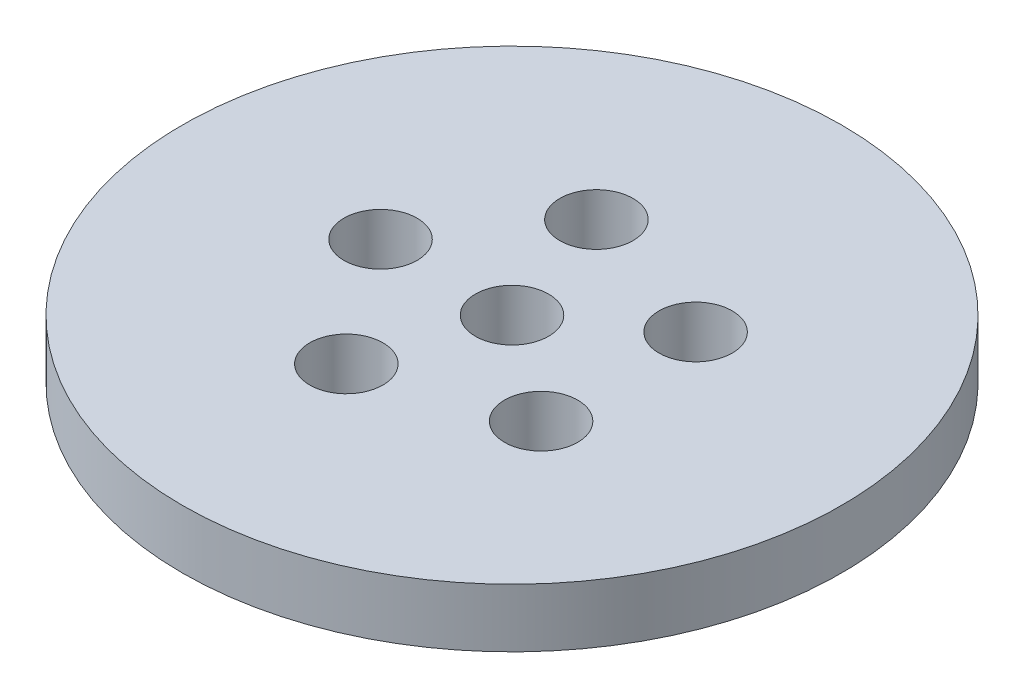
ISO-10303-21;
HEADER;
FILE_DESCRIPTION(('STEP AP214'),'2;1');
FILE_NAME('part.step','',(''),(''),'','','');
FILE_SCHEMA(('AUTOMOTIVE_DESIGN { 1 0 10303 214 1 1 1 1 }'));
ENDSEC;
DATA;
#1=APPLICATION_CONTEXT('core data for automotive mechanical design processes');
#2=APPLICATION_PROTOCOL_DEFINITION('international standard','automotive_design',2000,#1);
#3=PRODUCT_CONTEXT('',#1,'mechanical');
#4=PRODUCT('Part','Part','',(#3));
#5=PRODUCT_RELATED_PRODUCT_CATEGORY('part','',(#4));
#6=PRODUCT_DEFINITION_FORMATION('','',#4);
#7=PRODUCT_DEFINITION_CONTEXT('part definition',#1,'design');
#8=PRODUCT_DEFINITION('design','',#6,#7);
#9=PRODUCT_DEFINITION_SHAPE('','',#8);
#10=(LENGTH_UNIT() NAMED_UNIT(*) SI_UNIT(.MILLI.,.METRE.));
#11=(NAMED_UNIT(*) PLANE_ANGLE_UNIT() SI_UNIT($,.RADIAN.));
#12=(NAMED_UNIT(*) SI_UNIT($,.STERADIAN.) SOLID_ANGLE_UNIT());
#13=UNCERTAINTY_MEASURE_WITH_UNIT(LENGTH_MEASURE(1.E-05),#10,'distance_accuracy_value','');
#14=(GEOMETRIC_REPRESENTATION_CONTEXT(3) GLOBAL_UNCERTAINTY_ASSIGNED_CONTEXT((#13)) GLOBAL_UNIT_ASSIGNED_CONTEXT((#10,
#11,#12)) REPRESENTATION_CONTEXT('',''));
#15=CARTESIAN_POINT('',(0.,0.,0.));
#16=DIRECTION('',(0.,0.,1.));
#17=DIRECTION('',(1.,0.,0.));
#18=AXIS2_PLACEMENT_3D('',#15,#16,#17);
#19=CARTESIAN_POINT('',(0.,16.,0.));
#20=DIRECTION('',(0.,-1.,0.));
#21=DIRECTION('',(0.,0.,-1.));
#22=AXIS2_PLACEMENT_3D('',#19,#20,#21);
#23=CYLINDRICAL_SURFACE('',#22,90.);
#24=CARTESIAN_POINT('',(0.,16.,0.));
#25=DIRECTION('',(0.,1.,0.));
#26=DIRECTION('',(0.,0.,1.));
#27=AXIS2_PLACEMENT_3D('',#24,#25,#26);
#28=CIRCLE('',#27,90.);
#29=CARTESIAN_POINT('',(0.,16.,90.));
#30=VERTEX_POINT('',#29);
#31=EDGE_CURVE('E10',#30,#30,#28,.T.);
#32=ORIENTED_EDGE('',*,*,#31,.F.);
#33=EDGE_LOOP('',(#32));
#34=FACE_BOUND('',#33,.T.);
#35=CARTESIAN_POINT('',(0.,0.,0.));
#36=DIRECTION('',(0.,1.,0.));
#37=DIRECTION('',(0.,0.,1.));
#38=AXIS2_PLACEMENT_3D('',#35,#36,#37);
#39=CIRCLE('',#38,90.);
#40=CARTESIAN_POINT('',(0.,0.,90.));
#41=VERTEX_POINT('',#40);
#42=EDGE_CURVE('E37',#41,#41,#39,.T.);
#43=ORIENTED_EDGE('',*,*,#42,.T.);
#44=EDGE_LOOP('',(#43));
#45=FACE_BOUND('',#44,.T.);
#46=ADVANCED_FACE('F40',(#34,#45),#23,.T.);
#47=CARTESIAN_POINT('',(0.,16.,0.));
#48=DIRECTION('',(0.,1.,0.));
#49=DIRECTION('',(0.,0.,1.));
#50=AXIS2_PLACEMENT_3D('',#47,#48,#49);
#51=PLANE('',#50);
#52=CARTESIAN_POINT('',(-11.094567777278,16.,-34.1455686002023));
#53=DIRECTION('',(0.,1.,0.));
#54=DIRECTION('',(-0.95105651629515,0.,0.309016994374958));
#55=AXIS2_PLACEMENT_3D('',#52,#53,#54);
#56=CIRCLE('',#55,10.);
#57=CARTESIAN_POINT('',(-11.094567777278,16.,-24.1455686002023));
#58=VERTEX_POINT('',#57);
#59=EDGE_CURVE('E70',#58,#58,#56,.T.);
#60=ORIENTED_EDGE('',*,*,#59,.F.);
#61=EDGE_LOOP('',(#60));
#62=FACE_BOUND('',#61,.T.);
#63=CARTESIAN_POINT('',(29.0459555314021,16.,-21.1031219601165));
#64=DIRECTION('',(0.,1.,0.));
#65=DIRECTION('',(-0.58778525229248,0.,-0.809016994374942));
#66=AXIS2_PLACEMENT_3D('',#63,#64,#65);
#67=CIRCLE('',#66,10.);
#68=CARTESIAN_POINT('',(29.0459555314021,16.,-11.1031219601165));
#69=VERTEX_POINT('',#68);
#70=EDGE_CURVE('E71',#69,#69,#67,.T.);
#71=ORIENTED_EDGE('',*,*,#70,.F.);
#72=EDGE_LOOP('',(#71));
#73=FACE_BOUND('',#72,.T.);
#74=CARTESIAN_POINT('',(29.0459555314024,16.,21.1031219601161));
#75=DIRECTION('',(0.,1.,0.));
#76=DIRECTION('',(0.587785252292469,0.,-0.809016994374951));
#77=AXIS2_PLACEMENT_3D('',#74,#75,#76);
#78=CIRCLE('',#77,10.);
#79=CARTESIAN_POINT('',(29.0459555314024,16.,31.1031219601161));
#80=VERTEX_POINT('',#79);
#81=EDGE_CURVE('E78',#80,#80,#78,.T.);
#82=ORIENTED_EDGE('',*,*,#81,.F.);
#83=EDGE_LOOP('',(#82));
#84=FACE_BOUND('',#83,.T.);
#85=CARTESIAN_POINT('',(-11.0945677772775,16.,34.1455686002025));
#86=DIRECTION('',(0.,1.,0.));
#87=DIRECTION('',(0.951056516295155,0.,0.309016994374945));
#88=AXIS2_PLACEMENT_3D('',#85,#86,#87);
#89=CIRCLE('',#88,10.);
#90=CARTESIAN_POINT('',(-11.0945677772775,16.,44.1455686002025));
#91=VERTEX_POINT('',#90);
#92=EDGE_CURVE('E61',#91,#91,#89,.T.);
#93=ORIENTED_EDGE('',*,*,#92,.F.);
#94=EDGE_LOOP('',(#93));
#95=FACE_BOUND('',#94,.T.);
#96=CARTESIAN_POINT('',(-35.9027755082492,16.,0.));
#97=DIRECTION('',(0.,1.,0.));
#98=DIRECTION('',(0.,0.,1.));
#99=AXIS2_PLACEMENT_3D('',#96,#97,#98);
#100=CIRCLE('',#99,10.);
#101=CARTESIAN_POINT('',(-35.9027755082492,16.,10.));
#102=VERTEX_POINT('',#101);
#103=EDGE_CURVE('E54',#102,#102,#100,.T.);
#104=ORIENTED_EDGE('',*,*,#103,.F.);
#105=EDGE_LOOP('',(#104));
#106=FACE_BOUND('',#105,.T.);
#107=CARTESIAN_POINT('',(0.,16.,0.));
#108=DIRECTION('',(0.,1.,0.));
#109=DIRECTION('',(0.,0.,1.));
#110=AXIS2_PLACEMENT_3D('',#107,#108,#109);
#111=CIRCLE('',#110,10.);
#112=CARTESIAN_POINT('',(0.,16.,10.));
#113=VERTEX_POINT('',#112);
#114=EDGE_CURVE('E50',#113,#113,#111,.T.);
#115=ORIENTED_EDGE('',*,*,#114,.F.);
#116=EDGE_LOOP('',(#115));
#117=FACE_BOUND('',#116,.T.);
#118=ORIENTED_EDGE('',*,*,#31,.T.);
#119=EDGE_LOOP('',(#118));
#120=FACE_BOUND('',#119,.T.);
#121=ADVANCED_FACE('F94',(#62,#73,#84,#95,#106,#117,#120),#51,.T.);
#122=CARTESIAN_POINT('',(0.,0.,0.));
#123=DIRECTION('',(0.,1.,0.));
#124=DIRECTION('',(0.,0.,1.));
#125=AXIS2_PLACEMENT_3D('',#122,#123,#124);
#126=PLANE('',#125);
#127=CARTESIAN_POINT('',(0.,0.,0.));
#128=DIRECTION('',(0.,1.,0.));
#129=DIRECTION('',(0.,0.,1.));
#130=AXIS2_PLACEMENT_3D('',#127,#128,#129);
#131=CIRCLE('',#130,10.);
#132=CARTESIAN_POINT('',(0.,0.,10.));
#133=VERTEX_POINT('',#132);
#134=EDGE_CURVE('E47',#133,#133,#131,.T.);
#135=ORIENTED_EDGE('',*,*,#134,.T.);
#136=EDGE_LOOP('',(#135));
#137=FACE_BOUND('',#136,.T.);
#138=ORIENTED_EDGE('',*,*,#42,.F.);
#139=EDGE_LOOP('',(#138));
#140=FACE_BOUND('',#139,.T.);
#141=ADVANCED_FACE('F100',(#137,#140),#126,.F.);
#142=CARTESIAN_POINT('',(0.,16.,0.));
#143=DIRECTION('',(0.,-1.,0.));
#144=DIRECTION('',(0.,0.,-1.));
#145=AXIS2_PLACEMENT_3D('',#142,#143,#144);
#146=CYLINDRICAL_SURFACE('',#145,10.);
#147=ORIENTED_EDGE('',*,*,#114,.T.);
#148=EDGE_LOOP('',(#147));
#149=FACE_BOUND('',#148,.T.);
#150=ORIENTED_EDGE('',*,*,#134,.F.);
#151=EDGE_LOOP('',(#150));
#152=FACE_BOUND('',#151,.T.);
#153=ADVANCED_FACE('F106',(#149,#152),#146,.F.);
#154=CARTESIAN_POINT('',(-35.9027755082492,1.14669614993284,0.));
#155=DIRECTION('',(0.,1.,0.));
#156=DIRECTION('',(0.,0.,1.));
#157=AXIS2_PLACEMENT_3D('',#154,#155,#156);
#158=CYLINDRICAL_SURFACE('',#157,10.);
#159=CARTESIAN_POINT('',(-35.9027755082492,1.14669614993284,0.));
#160=DIRECTION('',(0.,1.,0.));
#161=DIRECTION('',(0.,0.,1.));
#162=AXIS2_PLACEMENT_3D('',#159,#160,#161);
#163=CIRCLE('',#162,10.);
#164=CARTESIAN_POINT('',(-35.9027755082492,1.14669614993284,10.));
#165=VERTEX_POINT('',#164);
#166=EDGE_CURVE('E55',#165,#165,#163,.T.);
#167=CARTESIAN_POINT('',(-35.9027755082492,1.14669614993284,10.));
#168=CARTESIAN_POINT('',(-35.9027755082492,1.30141806503771,10.));
#169=CARTESIAN_POINT('',(-35.9027755082492,1.45613998014257,10.));
#170=CARTESIAN_POINT('',(-35.9027755082492,1.7655838103523,10.));
#171=CARTESIAN_POINT('',(-35.9027755082492,1.92030572545717,10.));
#172=CARTESIAN_POINT('',(-35.9027755082492,2.2297495556669,10.));
#173=CARTESIAN_POINT('',(-35.9027755082492,2.38447147077177,10.));
#174=CARTESIAN_POINT('',(-35.9027755082492,2.6939153009815,10.));
#175=CARTESIAN_POINT('',(-35.9027755082492,2.84863721608637,10.));
#176=CARTESIAN_POINT('',(-35.9027755082492,3.1580810462961,10.));
#177=CARTESIAN_POINT('',(-35.9027755082492,3.31280296140097,10.));
#178=CARTESIAN_POINT('',(-35.9027755082492,3.6222467916107,10.));
#179=CARTESIAN_POINT('',(-35.9027755082492,3.77696870671557,10.));
#180=CARTESIAN_POINT('',(-35.9027755082492,4.0864125369253,10.));
#181=CARTESIAN_POINT('',(-35.9027755082492,4.24113445203017,10.));
#182=CARTESIAN_POINT('',(-35.9027755082492,4.5505782822399,10.));
#183=CARTESIAN_POINT('',(-35.9027755082492,4.70530019734476,10.));
#184=CARTESIAN_POINT('',(-35.9027755082492,5.0147440275545,10.));
#185=CARTESIAN_POINT('',(-35.9027755082492,5.16946594265936,10.));
#186=CARTESIAN_POINT('',(-35.9027755082492,5.47890977286909,10.));
#187=CARTESIAN_POINT('',(-35.9027755082492,5.63363168797396,10.));
#188=CARTESIAN_POINT('',(-35.9027755082492,5.94307551818369,10.));
#189=CARTESIAN_POINT('',(-35.9027755082492,6.09779743328856,10.));
#190=CARTESIAN_POINT('',(-35.9027755082492,6.40724126349829,10.));
#191=CARTESIAN_POINT('',(-35.9027755082492,6.56196317860316,10.));
#192=CARTESIAN_POINT('',(-35.9027755082492,6.87140700881289,10.));
#193=CARTESIAN_POINT('',(-35.9027755082492,7.02612892391776,10.));
#194=CARTESIAN_POINT('',(-35.9027755082492,7.33557275412749,10.));
#195=CARTESIAN_POINT('',(-35.9027755082492,7.49029466923236,10.));
#196=CARTESIAN_POINT('',(-35.9027755082492,7.79973849944209,10.));
#197=CARTESIAN_POINT('',(-35.9027755082492,7.95446041454695,10.));
#198=CARTESIAN_POINT('',(-35.9027755082492,8.26390424475669,10.));
#199=CARTESIAN_POINT('',(-35.9027755082492,8.41862615986155,10.));
#200=CARTESIAN_POINT('',(-35.9027755082492,8.72806999007129,10.));
#201=CARTESIAN_POINT('',(-35.9027755082492,8.88279190517615,10.));
#202=CARTESIAN_POINT('',(-35.9027755082492,9.19223573538588,10.));
#203=CARTESIAN_POINT('',(-35.9027755082492,9.34695765049075,10.));
#204=CARTESIAN_POINT('',(-35.9027755082492,9.65640148070048,10.));
#205=CARTESIAN_POINT('',(-35.9027755082492,9.81112339580535,10.));
#206=CARTESIAN_POINT('',(-35.9027755082492,10.1205672260151,10.));
#207=CARTESIAN_POINT('',(-35.9027755082492,10.2752891411199,10.));
#208=CARTESIAN_POINT('',(-35.9027755082492,10.5847329713297,10.));
#209=CARTESIAN_POINT('',(-35.9027755082492,10.7394548864345,10.));
#210=CARTESIAN_POINT('',(-35.9027755082492,11.0488987166443,10.));
#211=CARTESIAN_POINT('',(-35.9027755082492,11.2036206317491,10.));
#212=CARTESIAN_POINT('',(-35.9027755082492,11.5130644619589,10.));
#213=CARTESIAN_POINT('',(-35.9027755082492,11.6677863770637,10.));
#214=CARTESIAN_POINT('',(-35.9027755082492,11.9772302072735,10.));
#215=CARTESIAN_POINT('',(-35.9027755082492,12.1319521223783,10.));
#216=CARTESIAN_POINT('',(-35.9027755082492,12.4413959525881,10.));
#217=CARTESIAN_POINT('',(-35.9027755082492,12.5961178676929,10.));
#218=CARTESIAN_POINT('',(-35.9027755082492,12.9055616979027,10.));
#219=CARTESIAN_POINT('',(-35.9027755082492,13.0602836130075,10.));
#220=CARTESIAN_POINT('',(-35.9027755082492,13.3697274432173,10.));
#221=CARTESIAN_POINT('',(-35.9027755082492,13.5244493583221,10.));
#222=CARTESIAN_POINT('',(-35.9027755082492,13.8338931885319,10.));
#223=CARTESIAN_POINT('',(-35.9027755082492,13.9886151036367,10.));
#224=CARTESIAN_POINT('',(-35.9027755082492,14.2980589338465,10.));
#225=CARTESIAN_POINT('',(-35.9027755082492,14.4527808489513,10.));
#226=CARTESIAN_POINT('',(-35.9027755082492,14.7622246791611,10.));
#227=CARTESIAN_POINT('',(-35.9027755082492,14.9169465942659,10.));
#228=CARTESIAN_POINT('',(-35.9027755082492,15.2263904244757,10.));
#229=CARTESIAN_POINT('',(-35.9027755082492,15.3811123395805,10.));
#230=CARTESIAN_POINT('',(-35.9027755082492,15.6905561697903,10.));
#231=CARTESIAN_POINT('',(-35.9027755082492,15.8452780848951,10.));
#232=CARTESIAN_POINT('',(-35.9027755082492,16.,10.));
#233=B_SPLINE_CURVE_WITH_KNOTS('',3,(#167,#168,#169,#170,#171,#172,#173,#174,#175,#176,#177,
#178,#179,#180,#181,#182,#183,#184,#185,#186,#187,#188,#189,#190,#191,#192,#193,#194,#195,#196,
#197,#198,#199,#200,#201,#202,#203,#204,#205,#206,#207,#208,#209,#210,#211,#212,#213,#214,#215,
#216,#217,#218,#219,#220,#221,#222,#223,#224,#225,#226,#227,#228,#229,#230,#231,#232),
.UNSPECIFIED.,.F.,.F.,(4,2,2,2,2,2,2,2,2,2,2,2,2,2,2,2,2,2,2,2,2,2,2,2,2,2,2,2,2,2,2,2,4),(0.,
0.464165745314599,0.928331490629197,1.3924972359438,1.85666298125839,2.32082872657299,
2.78499447188759,3.24916021720219,3.71332596251679,4.17749170783139,4.64165745314599,
5.10582319846059,5.56998894377519,6.03415468908978,6.49832043440438,6.96248617971898,
7.42665192503358,7.89081767034818,8.35498341566278,8.81914916097737,9.28331490629197,
9.74748065160657,10.2116463969212,10.6758121422358,11.1399778875504,11.604143632865,
12.0683093781796,12.5324751234942,12.9966408688088,13.4608066141234,13.924972359438,
14.3891381047526,14.8533038500672),.UNSPECIFIED.);
#234=EDGE_CURVE('BSEAM108',#165,#102,#233,.T.);
#235=ORIENTED_EDGE('',*,*,#166,.F.);
#236=ORIENTED_EDGE('',*,*,#103,.T.);
#237=ORIENTED_EDGE('',*,*,#234,.T.);
#238=ORIENTED_EDGE('',*,*,#234,.F.);
#239=EDGE_LOOP('',(#235,#237,#236,#238));
#240=FACE_BOUND('',#239,.T.);
#241=ADVANCED_FACE('F108',(#240),#158,.F.);
#242=CARTESIAN_POINT('',(-35.9027755082492,1.14669614993284,0.));
#243=DIRECTION('',(0.,1.,0.));
#244=DIRECTION('',(0.,0.,1.));
#245=AXIS2_PLACEMENT_3D('',#242,#243,#244);
#246=PLANE('',#245);
#247=ORIENTED_EDGE('',*,*,#166,.T.);
#248=EDGE_LOOP('',(#247));
#249=FACE_BOUND('',#248,.T.);
#250=ADVANCED_FACE('F138',(#249),#246,.T.);
#251=CARTESIAN_POINT('',(-11.0945677772775,1.14669614993284,34.1455686002025));
#252=DIRECTION('',(0.,1.,0.));
#253=DIRECTION('',(0.,0.,1.));
#254=AXIS2_PLACEMENT_3D('',#251,#252,#253);
#255=CYLINDRICAL_SURFACE('',#254,10.);
#256=CARTESIAN_POINT('',(-11.0945677772775,1.14669614993284,34.1455686002025));
#257=DIRECTION('',(0.,1.,0.));
#258=DIRECTION('',(0.951056516295155,0.,0.309016994374945));
#259=AXIS2_PLACEMENT_3D('',#256,#257,#258);
#260=CIRCLE('',#259,10.);
#261=CARTESIAN_POINT('',(-11.0945677772775,1.14669614993284,44.1455686002025));
#262=VERTEX_POINT('',#261);
#263=EDGE_CURVE('E59',#262,#262,#260,.T.);
#264=CARTESIAN_POINT('',(-11.0945677772775,1.14669614993284,44.1455686002025));
#265=CARTESIAN_POINT('',(-11.0945677772775,1.30141806503771,44.1455686002025));
#266=CARTESIAN_POINT('',(-11.0945677772775,1.45613998014257,44.1455686002025));
#267=CARTESIAN_POINT('',(-11.0945677772775,1.7655838103523,44.1455686002025));
#268=CARTESIAN_POINT('',(-11.0945677772775,1.92030572545717,44.1455686002025));
#269=CARTESIAN_POINT('',(-11.0945677772775,2.2297495556669,44.1455686002025));
#270=CARTESIAN_POINT('',(-11.0945677772775,2.38447147077177,44.1455686002025));
#271=CARTESIAN_POINT('',(-11.0945677772775,2.6939153009815,44.1455686002025));
#272=CARTESIAN_POINT('',(-11.0945677772775,2.84863721608637,44.1455686002025));
#273=CARTESIAN_POINT('',(-11.0945677772775,3.1580810462961,44.1455686002025));
#274=CARTESIAN_POINT('',(-11.0945677772775,3.31280296140097,44.1455686002025));
#275=CARTESIAN_POINT('',(-11.0945677772775,3.6222467916107,44.1455686002025));
#276=CARTESIAN_POINT('',(-11.0945677772775,3.77696870671557,44.1455686002025));
#277=CARTESIAN_POINT('',(-11.0945677772775,4.0864125369253,44.1455686002025));
#278=CARTESIAN_POINT('',(-11.0945677772775,4.24113445203017,44.1455686002025));
#279=CARTESIAN_POINT('',(-11.0945677772775,4.5505782822399,44.1455686002025));
#280=CARTESIAN_POINT('',(-11.0945677772775,4.70530019734476,44.1455686002025));
#281=CARTESIAN_POINT('',(-11.0945677772775,5.0147440275545,44.1455686002025));
#282=CARTESIAN_POINT('',(-11.0945677772775,5.16946594265936,44.1455686002025));
#283=CARTESIAN_POINT('',(-11.0945677772775,5.47890977286909,44.1455686002025));
#284=CARTESIAN_POINT('',(-11.0945677772775,5.63363168797396,44.1455686002025));
#285=CARTESIAN_POINT('',(-11.0945677772775,5.94307551818369,44.1455686002025));
#286=CARTESIAN_POINT('',(-11.0945677772775,6.09779743328856,44.1455686002025));
#287=CARTESIAN_POINT('',(-11.0945677772775,6.40724126349829,44.1455686002025));
#288=CARTESIAN_POINT('',(-11.0945677772775,6.56196317860316,44.1455686002025));
#289=CARTESIAN_POINT('',(-11.0945677772775,6.87140700881289,44.1455686002025));
#290=CARTESIAN_POINT('',(-11.0945677772775,7.02612892391776,44.1455686002025));
#291=CARTESIAN_POINT('',(-11.0945677772775,7.33557275412749,44.1455686002025));
#292=CARTESIAN_POINT('',(-11.0945677772775,7.49029466923236,44.1455686002025));
#293=CARTESIAN_POINT('',(-11.0945677772775,7.79973849944209,44.1455686002025));
#294=CARTESIAN_POINT('',(-11.0945677772775,7.95446041454695,44.1455686002025));
#295=CARTESIAN_POINT('',(-11.0945677772775,8.26390424475669,44.1455686002025));
#296=CARTESIAN_POINT('',(-11.0945677772775,8.41862615986155,44.1455686002025));
#297=CARTESIAN_POINT('',(-11.0945677772775,8.72806999007129,44.1455686002025));
#298=CARTESIAN_POINT('',(-11.0945677772775,8.88279190517615,44.1455686002025));
#299=CARTESIAN_POINT('',(-11.0945677772775,9.19223573538588,44.1455686002025));
#300=CARTESIAN_POINT('',(-11.0945677772775,9.34695765049075,44.1455686002025));
#301=CARTESIAN_POINT('',(-11.0945677772775,9.65640148070048,44.1455686002025));
#302=CARTESIAN_POINT('',(-11.0945677772775,9.81112339580535,44.1455686002025));
#303=CARTESIAN_POINT('',(-11.0945677772775,10.1205672260151,44.1455686002025));
#304=CARTESIAN_POINT('',(-11.0945677772775,10.2752891411199,44.1455686002025));
#305=CARTESIAN_POINT('',(-11.0945677772775,10.5847329713297,44.1455686002025));
#306=CARTESIAN_POINT('',(-11.0945677772775,10.7394548864345,44.1455686002025));
#307=CARTESIAN_POINT('',(-11.0945677772775,11.0488987166443,44.1455686002025));
#308=CARTESIAN_POINT('',(-11.0945677772775,11.2036206317491,44.1455686002025));
#309=CARTESIAN_POINT('',(-11.0945677772775,11.5130644619589,44.1455686002025));
#310=CARTESIAN_POINT('',(-11.0945677772775,11.6677863770637,44.1455686002025));
#311=CARTESIAN_POINT('',(-11.0945677772775,11.9772302072735,44.1455686002025));
#312=CARTESIAN_POINT('',(-11.0945677772775,12.1319521223783,44.1455686002025));
#313=CARTESIAN_POINT('',(-11.0945677772775,12.4413959525881,44.1455686002025));
#314=CARTESIAN_POINT('',(-11.0945677772775,12.5961178676929,44.1455686002025));
#315=CARTESIAN_POINT('',(-11.0945677772775,12.9055616979027,44.1455686002025));
#316=CARTESIAN_POINT('',(-11.0945677772775,13.0602836130075,44.1455686002025));
#317=CARTESIAN_POINT('',(-11.0945677772775,13.3697274432173,44.1455686002025));
#318=CARTESIAN_POINT('',(-11.0945677772775,13.5244493583221,44.1455686002025));
#319=CARTESIAN_POINT('',(-11.0945677772775,13.8338931885319,44.1455686002025));
#320=CARTESIAN_POINT('',(-11.0945677772775,13.9886151036367,44.1455686002025));
#321=CARTESIAN_POINT('',(-11.0945677772775,14.2980589338465,44.1455686002025));
#322=CARTESIAN_POINT('',(-11.0945677772775,14.4527808489513,44.1455686002025));
#323=CARTESIAN_POINT('',(-11.0945677772775,14.7622246791611,44.1455686002025));
#324=CARTESIAN_POINT('',(-11.0945677772775,14.9169465942659,44.1455686002025));
#325=CARTESIAN_POINT('',(-11.0945677772775,15.2263904244757,44.1455686002025));
#326=CARTESIAN_POINT('',(-11.0945677772775,15.3811123395805,44.1455686002025));
#327=CARTESIAN_POINT('',(-11.0945677772775,15.6905561697903,44.1455686002025));
#328=CARTESIAN_POINT('',(-11.0945677772775,15.8452780848951,44.1455686002025));
#329=CARTESIAN_POINT('',(-11.0945677772775,16.,44.1455686002025));
#330=B_SPLINE_CURVE_WITH_KNOTS('',3,(#264,#265,#266,#267,#268,#269,#270,#271,#272,#273,#274,
#275,#276,#277,#278,#279,#280,#281,#282,#283,#284,#285,#286,#287,#288,#289,#290,#291,#292,#293,
#294,#295,#296,#297,#298,#299,#300,#301,#302,#303,#304,#305,#306,#307,#308,#309,#310,#311,#312,
#313,#314,#315,#316,#317,#318,#319,#320,#321,#322,#323,#324,#325,#326,#327,#328,#329),
.UNSPECIFIED.,.F.,.F.,(4,2,2,2,2,2,2,2,2,2,2,2,2,2,2,2,2,2,2,2,2,2,2,2,2,2,2,2,2,2,2,2,4),(0.,
0.464165745314599,0.928331490629197,1.3924972359438,1.85666298125839,2.32082872657299,
2.78499447188759,3.24916021720219,3.71332596251679,4.17749170783139,4.64165745314599,
5.10582319846059,5.56998894377519,6.03415468908978,6.49832043440438,6.96248617971898,
7.42665192503358,7.89081767034818,8.35498341566278,8.81914916097737,9.28331490629197,
9.74748065160657,10.2116463969212,10.6758121422358,11.1399778875504,11.604143632865,
12.0683093781796,12.5324751234942,12.9966408688088,13.4608066141234,13.924972359438,
14.3891381047526,14.8533038500672),.UNSPECIFIED.);
#331=EDGE_CURVE('BSEAM150',#262,#91,#330,.T.);
#332=ORIENTED_EDGE('',*,*,#263,.F.);
#333=ORIENTED_EDGE('',*,*,#92,.T.);
#334=ORIENTED_EDGE('',*,*,#331,.T.);
#335=ORIENTED_EDGE('',*,*,#331,.F.);
#336=EDGE_LOOP('',(#332,#334,#333,#335));
#337=FACE_BOUND('',#336,.T.);
#338=ADVANCED_FACE('F150',(#337),#255,.F.);
#339=CARTESIAN_POINT('',(-11.0945677772775,1.14669614993284,34.1455686002025));
#340=DIRECTION('',(0.,1.,0.));
#341=DIRECTION('',(0.951056516295155,0.,0.309016994374945));
#342=AXIS2_PLACEMENT_3D('',#339,#340,#341);
#343=PLANE('',#342);
#344=ORIENTED_EDGE('',*,*,#263,.T.);
#345=EDGE_LOOP('',(#344));
#346=FACE_BOUND('',#345,.T.);
#347=ADVANCED_FACE('F89',(#346),#343,.T.);
#348=CARTESIAN_POINT('',(29.0459555314024,1.14669614993284,21.1031219601161));
#349=DIRECTION('',(0.,1.,0.));
#350=DIRECTION('',(0.,0.,1.));
#351=AXIS2_PLACEMENT_3D('',#348,#349,#350);
#352=CYLINDRICAL_SURFACE('',#351,10.);
#353=CARTESIAN_POINT('',(29.0459555314024,1.14669614993284,21.1031219601161));
#354=DIRECTION('',(0.,1.,0.));
#355=DIRECTION('',(0.587785252292469,0.,-0.809016994374951));
#356=AXIS2_PLACEMENT_3D('',#353,#354,#355);
#357=CIRCLE('',#356,10.);
#358=CARTESIAN_POINT('',(29.0459555314024,1.14669614993284,31.1031219601161));
#359=VERTEX_POINT('',#358);
#360=EDGE_CURVE('E63',#359,#359,#357,.T.);
#361=CARTESIAN_POINT('',(29.0459555314024,1.14669614993284,31.1031219601161));
#362=CARTESIAN_POINT('',(29.0459555314024,1.30141806503771,31.1031219601161));
#363=CARTESIAN_POINT('',(29.0459555314024,1.45613998014257,31.1031219601161));
#364=CARTESIAN_POINT('',(29.0459555314024,1.7655838103523,31.1031219601161));
#365=CARTESIAN_POINT('',(29.0459555314024,1.92030572545717,31.1031219601161));
#366=CARTESIAN_POINT('',(29.0459555314024,2.2297495556669,31.1031219601161));
#367=CARTESIAN_POINT('',(29.0459555314024,2.38447147077177,31.1031219601161));
#368=CARTESIAN_POINT('',(29.0459555314024,2.6939153009815,31.1031219601161));
#369=CARTESIAN_POINT('',(29.0459555314024,2.84863721608637,31.1031219601161));
#370=CARTESIAN_POINT('',(29.0459555314024,3.1580810462961,31.1031219601161));
#371=CARTESIAN_POINT('',(29.0459555314024,3.31280296140097,31.1031219601161));
#372=CARTESIAN_POINT('',(29.0459555314024,3.6222467916107,31.1031219601161));
#373=CARTESIAN_POINT('',(29.0459555314024,3.77696870671557,31.1031219601161));
#374=CARTESIAN_POINT('',(29.0459555314024,4.0864125369253,31.1031219601161));
#375=CARTESIAN_POINT('',(29.0459555314024,4.24113445203017,31.1031219601161));
#376=CARTESIAN_POINT('',(29.0459555314024,4.5505782822399,31.1031219601161));
#377=CARTESIAN_POINT('',(29.0459555314024,4.70530019734476,31.1031219601161));
#378=CARTESIAN_POINT('',(29.0459555314024,5.0147440275545,31.1031219601161));
#379=CARTESIAN_POINT('',(29.0459555314024,5.16946594265936,31.1031219601161));
#380=CARTESIAN_POINT('',(29.0459555314024,5.47890977286909,31.1031219601161));
#381=CARTESIAN_POINT('',(29.0459555314024,5.63363168797396,31.1031219601161));
#382=CARTESIAN_POINT('',(29.0459555314024,5.94307551818369,31.1031219601161));
#383=CARTESIAN_POINT('',(29.0459555314024,6.09779743328856,31.1031219601161));
#384=CARTESIAN_POINT('',(29.0459555314024,6.40724126349829,31.1031219601161));
#385=CARTESIAN_POINT('',(29.0459555314024,6.56196317860316,31.1031219601161));
#386=CARTESIAN_POINT('',(29.0459555314024,6.87140700881289,31.1031219601161));
#387=CARTESIAN_POINT('',(29.0459555314024,7.02612892391776,31.1031219601161));
#388=CARTESIAN_POINT('',(29.0459555314024,7.33557275412749,31.1031219601161));
#389=CARTESIAN_POINT('',(29.0459555314024,7.49029466923236,31.1031219601161));
#390=CARTESIAN_POINT('',(29.0459555314024,7.79973849944209,31.1031219601161));
#391=CARTESIAN_POINT('',(29.0459555314024,7.95446041454695,31.1031219601161));
#392=CARTESIAN_POINT('',(29.0459555314024,8.26390424475669,31.1031219601161));
#393=CARTESIAN_POINT('',(29.0459555314024,8.41862615986155,31.1031219601161));
#394=CARTESIAN_POINT('',(29.0459555314024,8.72806999007129,31.1031219601161));
#395=CARTESIAN_POINT('',(29.0459555314024,8.88279190517615,31.1031219601161));
#396=CARTESIAN_POINT('',(29.0459555314024,9.19223573538588,31.1031219601161));
#397=CARTESIAN_POINT('',(29.0459555314024,9.34695765049075,31.1031219601161));
#398=CARTESIAN_POINT('',(29.0459555314024,9.65640148070048,31.1031219601161));
#399=CARTESIAN_POINT('',(29.0459555314024,9.81112339580535,31.1031219601161));
#400=CARTESIAN_POINT('',(29.0459555314024,10.1205672260151,31.1031219601161));
#401=CARTESIAN_POINT('',(29.0459555314024,10.2752891411199,31.1031219601161));
#402=CARTESIAN_POINT('',(29.0459555314024,10.5847329713297,31.1031219601161));
#403=CARTESIAN_POINT('',(29.0459555314024,10.7394548864345,31.1031219601161));
#404=CARTESIAN_POINT('',(29.0459555314024,11.0488987166443,31.1031219601161));
#405=CARTESIAN_POINT('',(29.0459555314024,11.2036206317491,31.1031219601161));
#406=CARTESIAN_POINT('',(29.0459555314024,11.5130644619589,31.1031219601161));
#407=CARTESIAN_POINT('',(29.0459555314024,11.6677863770637,31.1031219601161));
#408=CARTESIAN_POINT('',(29.0459555314024,11.9772302072735,31.1031219601161));
#409=CARTESIAN_POINT('',(29.0459555314024,12.1319521223783,31.1031219601161));
#410=CARTESIAN_POINT('',(29.0459555314024,12.4413959525881,31.1031219601161));
#411=CARTESIAN_POINT('',(29.0459555314024,12.5961178676929,31.1031219601161));
#412=CARTESIAN_POINT('',(29.0459555314024,12.9055616979027,31.1031219601161));
#413=CARTESIAN_POINT('',(29.0459555314024,13.0602836130075,31.1031219601161));
#414=CARTESIAN_POINT('',(29.0459555314024,13.3697274432173,31.1031219601161));
#415=CARTESIAN_POINT('',(29.0459555314024,13.5244493583221,31.1031219601161));
#416=CARTESIAN_POINT('',(29.0459555314024,13.8338931885319,31.1031219601161));
#417=CARTESIAN_POINT('',(29.0459555314024,13.9886151036367,31.1031219601161));
#418=CARTESIAN_POINT('',(29.0459555314024,14.2980589338465,31.1031219601161));
#419=CARTESIAN_POINT('',(29.0459555314024,14.4527808489513,31.1031219601161));
#420=CARTESIAN_POINT('',(29.0459555314024,14.7622246791611,31.1031219601161));
#421=CARTESIAN_POINT('',(29.0459555314024,14.9169465942659,31.1031219601161));
#422=CARTESIAN_POINT('',(29.0459555314024,15.2263904244757,31.1031219601161));
#423=CARTESIAN_POINT('',(29.0459555314024,15.3811123395805,31.1031219601161));
#424=CARTESIAN_POINT('',(29.0459555314024,15.6905561697903,31.1031219601161));
#425=CARTESIAN_POINT('',(29.0459555314024,15.8452780848951,31.1031219601161));
#426=CARTESIAN_POINT('',(29.0459555314024,16.,31.1031219601161));
#427=B_SPLINE_CURVE_WITH_KNOTS('',3,(#361,#362,#363,#364,#365,#366,#367,#368,#369,#370,#371,
#372,#373,#374,#375,#376,#377,#378,#379,#380,#381,#382,#383,#384,#385,#386,#387,#388,#389,#390,
#391,#392,#393,#394,#395,#396,#397,#398,#399,#400,#401,#402,#403,#404,#405,#406,#407,#408,#409,
#410,#411,#412,#413,#414,#415,#416,#417,#418,#419,#420,#421,#422,#423,#424,#425,#426),
.UNSPECIFIED.,.F.,.F.,(4,2,2,2,2,2,2,2,2,2,2,2,2,2,2,2,2,2,2,2,2,2,2,2,2,2,2,2,2,2,2,2,4),(0.,
0.464165745314599,0.928331490629197,1.3924972359438,1.85666298125839,2.32082872657299,
2.78499447188759,3.24916021720219,3.71332596251679,4.17749170783139,4.64165745314599,
5.10582319846059,5.56998894377519,6.03415468908978,6.49832043440438,6.96248617971898,
7.42665192503358,7.89081767034818,8.35498341566278,8.81914916097737,9.28331490629197,
9.74748065160657,10.2116463969212,10.6758121422358,11.1399778875504,11.604143632865,
12.0683093781796,12.5324751234942,12.9966408688088,13.4608066141234,13.924972359438,
14.3891381047526,14.8533038500672),.UNSPECIFIED.);
#428=EDGE_CURVE('BSEAM87',#359,#80,#427,.T.);
#429=ORIENTED_EDGE('',*,*,#360,.F.);
#430=ORIENTED_EDGE('',*,*,#81,.T.);
#431=ORIENTED_EDGE('',*,*,#428,.T.);
#432=ORIENTED_EDGE('',*,*,#428,.F.);
#433=EDGE_LOOP('',(#429,#431,#430,#432));
#434=FACE_BOUND('',#433,.T.);
#435=ADVANCED_FACE('F87',(#434),#352,.F.);
#436=CARTESIAN_POINT('',(29.0459555314024,1.14669614993284,21.1031219601161));
#437=DIRECTION('',(0.,1.,0.));
#438=DIRECTION('',(0.587785252292469,0.,-0.809016994374951));
#439=AXIS2_PLACEMENT_3D('',#436,#437,#438);
#440=PLANE('',#439);
#441=ORIENTED_EDGE('',*,*,#360,.T.);
#442=EDGE_LOOP('',(#441));
#443=FACE_BOUND('',#442,.T.);
#444=ADVANCED_FACE('F84',(#443),#440,.T.);
#445=CARTESIAN_POINT('',(29.0459555314021,1.14669614993284,-21.1031219601165));
#446=DIRECTION('',(0.,1.,0.));
#447=DIRECTION('',(0.,0.,1.));
#448=AXIS2_PLACEMENT_3D('',#445,#446,#447);
#449=CYLINDRICAL_SURFACE('',#448,10.);
#450=CARTESIAN_POINT('',(29.0459555314021,1.14669614993284,-21.1031219601165));
#451=DIRECTION('',(0.,1.,0.));
#452=DIRECTION('',(-0.58778525229248,0.,-0.809016994374942));
#453=AXIS2_PLACEMENT_3D('',#450,#451,#452);
#454=CIRCLE('',#453,10.);
#455=CARTESIAN_POINT('',(29.0459555314021,1.14669614993284,-11.1031219601165));
#456=VERTEX_POINT('',#455);
#457=EDGE_CURVE('E76',#456,#456,#454,.T.);
#458=CARTESIAN_POINT('',(29.0459555314021,1.14669614993284,-11.1031219601165));
#459=CARTESIAN_POINT('',(29.0459555314021,1.30141806503771,-11.1031219601165));
#460=CARTESIAN_POINT('',(29.0459555314021,1.45613998014257,-11.1031219601165));
#461=CARTESIAN_POINT('',(29.0459555314021,1.7655838103523,-11.1031219601165));
#462=CARTESIAN_POINT('',(29.0459555314021,1.92030572545717,-11.1031219601165));
#463=CARTESIAN_POINT('',(29.0459555314021,2.2297495556669,-11.1031219601165));
#464=CARTESIAN_POINT('',(29.0459555314021,2.38447147077177,-11.1031219601165));
#465=CARTESIAN_POINT('',(29.0459555314021,2.6939153009815,-11.1031219601165));
#466=CARTESIAN_POINT('',(29.0459555314021,2.84863721608637,-11.1031219601165));
#467=CARTESIAN_POINT('',(29.0459555314021,3.1580810462961,-11.1031219601165));
#468=CARTESIAN_POINT('',(29.0459555314021,3.31280296140097,-11.1031219601165));
#469=CARTESIAN_POINT('',(29.0459555314021,3.6222467916107,-11.1031219601165));
#470=CARTESIAN_POINT('',(29.0459555314021,3.77696870671557,-11.1031219601165));
#471=CARTESIAN_POINT('',(29.0459555314021,4.0864125369253,-11.1031219601165));
#472=CARTESIAN_POINT('',(29.0459555314021,4.24113445203017,-11.1031219601165));
#473=CARTESIAN_POINT('',(29.0459555314021,4.5505782822399,-11.1031219601165));
#474=CARTESIAN_POINT('',(29.0459555314021,4.70530019734476,-11.1031219601165));
#475=CARTESIAN_POINT('',(29.0459555314021,5.0147440275545,-11.1031219601165));
#476=CARTESIAN_POINT('',(29.0459555314021,5.16946594265936,-11.1031219601165));
#477=CARTESIAN_POINT('',(29.0459555314021,5.47890977286909,-11.1031219601165));
#478=CARTESIAN_POINT('',(29.0459555314021,5.63363168797396,-11.1031219601165));
#479=CARTESIAN_POINT('',(29.0459555314021,5.94307551818369,-11.1031219601165));
#480=CARTESIAN_POINT('',(29.0459555314021,6.09779743328856,-11.1031219601165));
#481=CARTESIAN_POINT('',(29.0459555314021,6.40724126349829,-11.1031219601165));
#482=CARTESIAN_POINT('',(29.0459555314021,6.56196317860316,-11.1031219601165));
#483=CARTESIAN_POINT('',(29.0459555314021,6.87140700881289,-11.1031219601165));
#484=CARTESIAN_POINT('',(29.0459555314021,7.02612892391776,-11.1031219601165));
#485=CARTESIAN_POINT('',(29.0459555314021,7.33557275412749,-11.1031219601165));
#486=CARTESIAN_POINT('',(29.0459555314021,7.49029466923236,-11.1031219601165));
#487=CARTESIAN_POINT('',(29.0459555314021,7.79973849944209,-11.1031219601165));
#488=CARTESIAN_POINT('',(29.0459555314021,7.95446041454695,-11.1031219601165));
#489=CARTESIAN_POINT('',(29.0459555314021,8.26390424475669,-11.1031219601165));
#490=CARTESIAN_POINT('',(29.0459555314021,8.41862615986155,-11.1031219601165));
#491=CARTESIAN_POINT('',(29.0459555314021,8.72806999007129,-11.1031219601165));
#492=CARTESIAN_POINT('',(29.0459555314021,8.88279190517615,-11.1031219601165));
#493=CARTESIAN_POINT('',(29.0459555314021,9.19223573538588,-11.1031219601165));
#494=CARTESIAN_POINT('',(29.0459555314021,9.34695765049075,-11.1031219601165));
#495=CARTESIAN_POINT('',(29.0459555314021,9.65640148070048,-11.1031219601165));
#496=CARTESIAN_POINT('',(29.0459555314021,9.81112339580535,-11.1031219601165));
#497=CARTESIAN_POINT('',(29.0459555314021,10.1205672260151,-11.1031219601165));
#498=CARTESIAN_POINT('',(29.0459555314021,10.2752891411199,-11.1031219601165));
#499=CARTESIAN_POINT('',(29.0459555314021,10.5847329713297,-11.1031219601165));
#500=CARTESIAN_POINT('',(29.0459555314021,10.7394548864345,-11.1031219601165));
#501=CARTESIAN_POINT('',(29.0459555314021,11.0488987166443,-11.1031219601165));
#502=CARTESIAN_POINT('',(29.0459555314021,11.2036206317491,-11.1031219601165));
#503=CARTESIAN_POINT('',(29.0459555314021,11.5130644619589,-11.1031219601165));
#504=CARTESIAN_POINT('',(29.0459555314021,11.6677863770637,-11.1031219601165));
#505=CARTESIAN_POINT('',(29.0459555314021,11.9772302072735,-11.1031219601165));
#506=CARTESIAN_POINT('',(29.0459555314021,12.1319521223783,-11.1031219601165));
#507=CARTESIAN_POINT('',(29.0459555314021,12.4413959525881,-11.1031219601165));
#508=CARTESIAN_POINT('',(29.0459555314021,12.5961178676929,-11.1031219601165));
#509=CARTESIAN_POINT('',(29.0459555314021,12.9055616979027,-11.1031219601165));
#510=CARTESIAN_POINT('',(29.0459555314021,13.0602836130075,-11.1031219601165));
#511=CARTESIAN_POINT('',(29.0459555314021,13.3697274432173,-11.1031219601165));
#512=CARTESIAN_POINT('',(29.0459555314021,13.5244493583221,-11.1031219601165));
#513=CARTESIAN_POINT('',(29.0459555314021,13.8338931885319,-11.1031219601165));
#514=CARTESIAN_POINT('',(29.0459555314021,13.9886151036367,-11.1031219601165));
#515=CARTESIAN_POINT('',(29.0459555314021,14.2980589338465,-11.1031219601165));
#516=CARTESIAN_POINT('',(29.0459555314021,14.4527808489513,-11.1031219601165));
#517=CARTESIAN_POINT('',(29.0459555314021,14.7622246791611,-11.1031219601165));
#518=CARTESIAN_POINT('',(29.0459555314021,14.9169465942659,-11.1031219601165));
#519=CARTESIAN_POINT('',(29.0459555314021,15.2263904244757,-11.1031219601165));
#520=CARTESIAN_POINT('',(29.0459555314021,15.3811123395805,-11.1031219601165));
#521=CARTESIAN_POINT('',(29.0459555314021,15.6905561697903,-11.1031219601165));
#522=CARTESIAN_POINT('',(29.0459555314021,15.8452780848951,-11.1031219601165));
#523=CARTESIAN_POINT('',(29.0459555314021,16.,-11.1031219601165));
#524=B_SPLINE_CURVE_WITH_KNOTS('',3,(#458,#459,#460,#461,#462,#463,#464,#465,#466,#467,#468,
#469,#470,#471,#472,#473,#474,#475,#476,#477,#478,#479,#480,#481,#482,#483,#484,#485,#486,#487,
#488,#489,#490,#491,#492,#493,#494,#495,#496,#497,#498,#499,#500,#501,#502,#503,#504,#505,#506,
#507,#508,#509,#510,#511,#512,#513,#514,#515,#516,#517,#518,#519,#520,#521,#522,#523),
.UNSPECIFIED.,.F.,.F.,(4,2,2,2,2,2,2,2,2,2,2,2,2,2,2,2,2,2,2,2,2,2,2,2,2,2,2,2,2,2,2,2,4),(0.,
0.464165745314599,0.928331490629197,1.3924972359438,1.85666298125839,2.32082872657299,
2.78499447188759,3.24916021720219,3.71332596251679,4.17749170783139,4.64165745314599,
5.10582319846059,5.56998894377519,6.03415468908978,6.49832043440438,6.96248617971898,
7.42665192503358,7.89081767034818,8.35498341566278,8.81914916097737,9.28331490629197,
9.74748065160657,10.2116463969212,10.6758121422358,11.1399778875504,11.604143632865,
12.0683093781796,12.5324751234942,12.9966408688088,13.4608066141234,13.924972359438,
14.3891381047526,14.8533038500672),.UNSPECIFIED.);
#525=EDGE_CURVE('BSEAM185',#456,#69,#524,.T.);
#526=ORIENTED_EDGE('',*,*,#457,.F.);
#527=ORIENTED_EDGE('',*,*,#70,.T.);
#528=ORIENTED_EDGE('',*,*,#525,.T.);
#529=ORIENTED_EDGE('',*,*,#525,.F.);
#530=EDGE_LOOP('',(#526,#528,#527,#529));
#531=FACE_BOUND('',#530,.T.);
#532=ADVANCED_FACE('F185',(#531),#449,.F.);
#533=CARTESIAN_POINT('',(29.0459555314021,1.14669614993284,-21.1031219601165));
#534=DIRECTION('',(0.,1.,0.));
#535=DIRECTION('',(-0.58778525229248,0.,-0.809016994374942));
#536=AXIS2_PLACEMENT_3D('',#533,#534,#535);
#537=PLANE('',#536);
#538=ORIENTED_EDGE('',*,*,#457,.T.);
#539=EDGE_LOOP('',(#538));
#540=FACE_BOUND('',#539,.T.);
#541=ADVANCED_FACE('F189',(#540),#537,.T.);
#542=CARTESIAN_POINT('',(-11.094567777278,1.14669614993284,-34.1455686002023));
#543=DIRECTION('',(0.,1.,0.));
#544=DIRECTION('',(0.,0.,1.));
#545=AXIS2_PLACEMENT_3D('',#542,#543,#544);
#546=CYLINDRICAL_SURFACE('',#545,10.);
#547=CARTESIAN_POINT('',(-11.094567777278,1.14669614993284,-34.1455686002023));
#548=DIRECTION('',(0.,1.,0.));
#549=DIRECTION('',(-0.95105651629515,0.,0.309016994374958));
#550=AXIS2_PLACEMENT_3D('',#547,#548,#549);
#551=CIRCLE('',#550,10.);
#552=CARTESIAN_POINT('',(-11.094567777278,1.14669614993284,-24.1455686002023));
#553=VERTEX_POINT('',#552);
#554=EDGE_CURVE('E69',#553,#553,#551,.T.);
#555=CARTESIAN_POINT('',(-11.094567777278,1.14669614993284,-24.1455686002023));
#556=CARTESIAN_POINT('',(-11.094567777278,1.30141806503771,-24.1455686002023));
#557=CARTESIAN_POINT('',(-11.094567777278,1.45613998014257,-24.1455686002023));
#558=CARTESIAN_POINT('',(-11.094567777278,1.7655838103523,-24.1455686002023));
#559=CARTESIAN_POINT('',(-11.094567777278,1.92030572545717,-24.1455686002023));
#560=CARTESIAN_POINT('',(-11.094567777278,2.2297495556669,-24.1455686002023));
#561=CARTESIAN_POINT('',(-11.094567777278,2.38447147077177,-24.1455686002023));
#562=CARTESIAN_POINT('',(-11.094567777278,2.6939153009815,-24.1455686002023));
#563=CARTESIAN_POINT('',(-11.094567777278,2.84863721608637,-24.1455686002023));
#564=CARTESIAN_POINT('',(-11.094567777278,3.1580810462961,-24.1455686002023));
#565=CARTESIAN_POINT('',(-11.094567777278,3.31280296140097,-24.1455686002023));
#566=CARTESIAN_POINT('',(-11.094567777278,3.6222467916107,-24.1455686002023));
#567=CARTESIAN_POINT('',(-11.094567777278,3.77696870671557,-24.1455686002023));
#568=CARTESIAN_POINT('',(-11.094567777278,4.0864125369253,-24.1455686002023));
#569=CARTESIAN_POINT('',(-11.094567777278,4.24113445203017,-24.1455686002023));
#570=CARTESIAN_POINT('',(-11.094567777278,4.5505782822399,-24.1455686002023));
#571=CARTESIAN_POINT('',(-11.094567777278,4.70530019734476,-24.1455686002023));
#572=CARTESIAN_POINT('',(-11.094567777278,5.0147440275545,-24.1455686002023));
#573=CARTESIAN_POINT('',(-11.094567777278,5.16946594265936,-24.1455686002023));
#574=CARTESIAN_POINT('',(-11.094567777278,5.47890977286909,-24.1455686002023));
#575=CARTESIAN_POINT('',(-11.094567777278,5.63363168797396,-24.1455686002023));
#576=CARTESIAN_POINT('',(-11.094567777278,5.94307551818369,-24.1455686002023));
#577=CARTESIAN_POINT('',(-11.094567777278,6.09779743328856,-24.1455686002023));
#578=CARTESIAN_POINT('',(-11.094567777278,6.40724126349829,-24.1455686002023));
#579=CARTESIAN_POINT('',(-11.094567777278,6.56196317860316,-24.1455686002023));
#580=CARTESIAN_POINT('',(-11.094567777278,6.87140700881289,-24.1455686002023));
#581=CARTESIAN_POINT('',(-11.094567777278,7.02612892391776,-24.1455686002023));
#582=CARTESIAN_POINT('',(-11.094567777278,7.33557275412749,-24.1455686002023));
#583=CARTESIAN_POINT('',(-11.094567777278,7.49029466923236,-24.1455686002023));
#584=CARTESIAN_POINT('',(-11.094567777278,7.79973849944209,-24.1455686002023));
#585=CARTESIAN_POINT('',(-11.094567777278,7.95446041454695,-24.1455686002023));
#586=CARTESIAN_POINT('',(-11.094567777278,8.26390424475669,-24.1455686002023));
#587=CARTESIAN_POINT('',(-11.094567777278,8.41862615986155,-24.1455686002023));
#588=CARTESIAN_POINT('',(-11.094567777278,8.72806999007129,-24.1455686002023));
#589=CARTESIAN_POINT('',(-11.094567777278,8.88279190517615,-24.1455686002023));
#590=CARTESIAN_POINT('',(-11.094567777278,9.19223573538588,-24.1455686002023));
#591=CARTESIAN_POINT('',(-11.094567777278,9.34695765049075,-24.1455686002023));
#592=CARTESIAN_POINT('',(-11.094567777278,9.65640148070048,-24.1455686002023));
#593=CARTESIAN_POINT('',(-11.094567777278,9.81112339580535,-24.1455686002023));
#594=CARTESIAN_POINT('',(-11.094567777278,10.1205672260151,-24.1455686002023));
#595=CARTESIAN_POINT('',(-11.094567777278,10.2752891411199,-24.1455686002023));
#596=CARTESIAN_POINT('',(-11.094567777278,10.5847329713297,-24.1455686002023));
#597=CARTESIAN_POINT('',(-11.094567777278,10.7394548864345,-24.1455686002023));
#598=CARTESIAN_POINT('',(-11.094567777278,11.0488987166443,-24.1455686002023));
#599=CARTESIAN_POINT('',(-11.094567777278,11.2036206317491,-24.1455686002023));
#600=CARTESIAN_POINT('',(-11.094567777278,11.5130644619589,-24.1455686002023));
#601=CARTESIAN_POINT('',(-11.094567777278,11.6677863770637,-24.1455686002023));
#602=CARTESIAN_POINT('',(-11.094567777278,11.9772302072735,-24.1455686002023));
#603=CARTESIAN_POINT('',(-11.094567777278,12.1319521223783,-24.1455686002023));
#604=CARTESIAN_POINT('',(-11.094567777278,12.4413959525881,-24.1455686002023));
#605=CARTESIAN_POINT('',(-11.094567777278,12.5961178676929,-24.1455686002023));
#606=CARTESIAN_POINT('',(-11.094567777278,12.9055616979027,-24.1455686002023));
#607=CARTESIAN_POINT('',(-11.094567777278,13.0602836130075,-24.1455686002023));
#608=CARTESIAN_POINT('',(-11.094567777278,13.3697274432173,-24.1455686002023));
#609=CARTESIAN_POINT('',(-11.094567777278,13.5244493583221,-24.1455686002023));
#610=CARTESIAN_POINT('',(-11.094567777278,13.8338931885319,-24.1455686002023));
#611=CARTESIAN_POINT('',(-11.094567777278,13.9886151036367,-24.1455686002023));
#612=CARTESIAN_POINT('',(-11.094567777278,14.2980589338465,-24.1455686002023));
#613=CARTESIAN_POINT('',(-11.094567777278,14.4527808489513,-24.1455686002023));
#614=CARTESIAN_POINT('',(-11.094567777278,14.7622246791611,-24.1455686002023));
#615=CARTESIAN_POINT('',(-11.094567777278,14.9169465942659,-24.1455686002023));
#616=CARTESIAN_POINT('',(-11.094567777278,15.2263904244757,-24.1455686002023));
#617=CARTESIAN_POINT('',(-11.094567777278,15.3811123395805,-24.1455686002023));
#618=CARTESIAN_POINT('',(-11.094567777278,15.6905561697903,-24.1455686002023));
#619=CARTESIAN_POINT('',(-11.094567777278,15.8452780848951,-24.1455686002023));
#620=CARTESIAN_POINT('',(-11.094567777278,16.,-24.1455686002023));
#621=B_SPLINE_CURVE_WITH_KNOTS('',3,(#555,#556,#557,#558,#559,#560,#561,#562,#563,#564,#565,
#566,#567,#568,#569,#570,#571,#572,#573,#574,#575,#576,#577,#578,#579,#580,#581,#582,#583,#584,
#585,#586,#587,#588,#589,#590,#591,#592,#593,#594,#595,#596,#597,#598,#599,#600,#601,#602,#603,
#604,#605,#606,#607,#608,#609,#610,#611,#612,#613,#614,#615,#616,#617,#618,#619,#620),
.UNSPECIFIED.,.F.,.F.,(4,2,2,2,2,2,2,2,2,2,2,2,2,2,2,2,2,2,2,2,2,2,2,2,2,2,2,2,2,2,2,2,4),(0.,
0.464165745314599,0.928331490629197,1.3924972359438,1.85666298125839,2.32082872657299,
2.78499447188759,3.24916021720219,3.71332596251679,4.17749170783139,4.64165745314599,
5.10582319846059,5.56998894377519,6.03415468908978,6.49832043440438,6.96248617971898,
7.42665192503358,7.89081767034818,8.35498341566278,8.81914916097737,9.28331490629197,
9.74748065160657,10.2116463969212,10.6758121422358,11.1399778875504,11.604143632865,
12.0683093781796,12.5324751234942,12.9966408688088,13.4608066141234,13.924972359438,
14.3891381047526,14.8533038500672),.UNSPECIFIED.);
#622=EDGE_CURVE('BSEAM200',#553,#58,#621,.T.);
#623=ORIENTED_EDGE('',*,*,#554,.F.);
#624=ORIENTED_EDGE('',*,*,#59,.T.);
#625=ORIENTED_EDGE('',*,*,#622,.T.);
#626=ORIENTED_EDGE('',*,*,#622,.F.);
#627=EDGE_LOOP('',(#623,#625,#624,#626));
#628=FACE_BOUND('',#627,.T.);
#629=ADVANCED_FACE('F200',(#628),#546,.F.);
#630=CARTESIAN_POINT('',(-11.094567777278,1.14669614993284,-34.1455686002023));
#631=DIRECTION('',(0.,1.,0.));
#632=DIRECTION('',(-0.95105651629515,0.,0.309016994374958));
#633=AXIS2_PLACEMENT_3D('',#630,#631,#632);
#634=PLANE('',#633);
#635=ORIENTED_EDGE('',*,*,#554,.T.);
#636=EDGE_LOOP('',(#635));
#637=FACE_BOUND('',#636,.T.);
#638=ADVANCED_FACE('F208',(#637),#634,.T.);
#639=CLOSED_SHELL('',(#46,#121,#141,#153,#241,#250,#338,#347,#435,#444,#532,#541,#629,#638));
#640=MANIFOLD_SOLID_BREP('B2',#639);
#641=ADVANCED_BREP_SHAPE_REPRESENTATION('',(#18,#640),#14);
#642=SHAPE_DEFINITION_REPRESENTATION(#9,#641);
ENDSEC;
END-ISO-10303-21;
